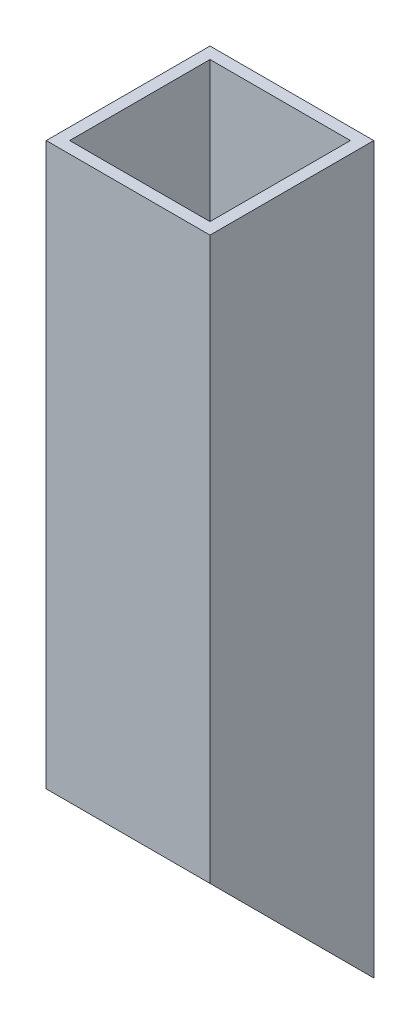
ISO-10303-21;
HEADER;
FILE_DESCRIPTION(('STEP AP214'),'2;1');
FILE_NAME('part.step','',(''),(''),'','','');
FILE_SCHEMA(('AUTOMOTIVE_DESIGN { 1 0 10303 214 1 1 1 1 }'));
ENDSEC;
DATA;
#1=APPLICATION_CONTEXT('core data for automotive mechanical design processes');
#2=APPLICATION_PROTOCOL_DEFINITION('international standard','automotive_design',2000,#1);
#3=PRODUCT_CONTEXT('',#1,'mechanical');
#4=PRODUCT('Part','Part','',(#3));
#5=PRODUCT_RELATED_PRODUCT_CATEGORY('part','',(#4));
#6=PRODUCT_DEFINITION_FORMATION('','',#4);
#7=PRODUCT_DEFINITION_CONTEXT('part definition',#1,'design');
#8=PRODUCT_DEFINITION('design','',#6,#7);
#9=PRODUCT_DEFINITION_SHAPE('','',#8);
#10=(LENGTH_UNIT() NAMED_UNIT(*) SI_UNIT(.MILLI.,.METRE.));
#11=(NAMED_UNIT(*) PLANE_ANGLE_UNIT() SI_UNIT($,.RADIAN.));
#12=(NAMED_UNIT(*) SI_UNIT($,.STERADIAN.) SOLID_ANGLE_UNIT());
#13=UNCERTAINTY_MEASURE_WITH_UNIT(LENGTH_MEASURE(1.E-05),#10,'distance_accuracy_value','');
#14=(GEOMETRIC_REPRESENTATION_CONTEXT(3) GLOBAL_UNCERTAINTY_ASSIGNED_CONTEXT((#13)) GLOBAL_UNIT_ASSIGNED_CONTEXT((#10,
#11,#12)) REPRESENTATION_CONTEXT('',''));
#15=CARTESIAN_POINT('',(0.,0.,0.));
#16=DIRECTION('',(0.,0.,1.));
#17=DIRECTION('',(1.,0.,0.));
#18=AXIS2_PLACEMENT_3D('',#15,#16,#17);
#19=CARTESIAN_POINT('',(0.,196.85,0.));
#20=DIRECTION('',(0.,-1.,0.));
#21=DIRECTION('',(0.,0.,-1.));
#22=AXIS2_PLACEMENT_3D('',#19,#20,#21);
#23=PLANE('',#22);
#24=DIRECTION('',(0.,0.,1.));
#25=VECTOR('',#24,1.);
#26=CARTESIAN_POINT('',(0.,196.85,0.));
#27=LINE('',#26,#25);
#28=CARTESIAN_POINT('',(0.,196.85,-44.45));
#29=VERTEX_POINT('',#28);
#30=CARTESIAN_POINT('',(0.,196.85,0.));
#31=VERTEX_POINT('',#30);
#32=EDGE_CURVE('E121',#29,#31,#27,.T.);
#33=ORIENTED_EDGE('',*,*,#32,.T.);
#34=DIRECTION('',(1.,0.,0.));
#35=VECTOR('',#34,1.);
#36=CARTESIAN_POINT('',(0.,196.85,0.));
#37=LINE('',#36,#35);
#38=CARTESIAN_POINT('',(44.45,196.85,0.));
#39=VERTEX_POINT('',#38);
#40=EDGE_CURVE('E127',#31,#39,#37,.T.);
#41=ORIENTED_EDGE('',*,*,#40,.T.);
#42=DIRECTION('',(0.,0.,-1.));
#43=VECTOR('',#42,1.);
#44=CARTESIAN_POINT('',(44.45,196.85,0.));
#45=LINE('',#44,#43);
#46=CARTESIAN_POINT('',(44.45,196.85,-44.45));
#47=VERTEX_POINT('',#46);
#48=EDGE_CURVE('E124',#39,#47,#45,.T.);
#49=ORIENTED_EDGE('',*,*,#48,.T.);
#50=DIRECTION('',(-1.,0.,0.));
#51=VECTOR('',#50,1.);
#52=CARTESIAN_POINT('',(0.,196.85,-44.45));
#53=LINE('',#52,#51);
#54=EDGE_CURVE('E118',#47,#29,#53,.T.);
#55=ORIENTED_EDGE('',*,*,#54,.T.);
#56=EDGE_LOOP('',(#33,#41,#49,#55));
#57=FACE_BOUND('',#56,.T.);
#58=DIRECTION('',(1.,0.,0.));
#59=VECTOR('',#58,1.);
#60=CARTESIAN_POINT('',(3.175,196.85,-3.175));
#61=LINE('',#60,#59);
#62=CARTESIAN_POINT('',(3.175,196.85,-3.175));
#63=VERTEX_POINT('',#62);
#64=CARTESIAN_POINT('',(41.275,196.85,-3.175));
#65=VERTEX_POINT('',#64);
#66=EDGE_CURVE('E89',#63,#65,#61,.T.);
#67=ORIENTED_EDGE('',*,*,#66,.F.);
#68=DIRECTION('',(0.,0.,1.));
#69=VECTOR('',#68,1.);
#70=CARTESIAN_POINT('',(3.175,196.85,-3.175));
#71=LINE('',#70,#69);
#72=CARTESIAN_POINT('',(3.175,196.85,-41.275));
#73=VERTEX_POINT('',#72);
#74=EDGE_CURVE('E137',#73,#63,#71,.T.);
#75=ORIENTED_EDGE('',*,*,#74,.F.);
#76=DIRECTION('',(-1.,0.,0.));
#77=VECTOR('',#76,1.);
#78=CARTESIAN_POINT('',(3.175,196.85,-41.275));
#79=LINE('',#78,#77);
#80=CARTESIAN_POINT('',(41.275,196.85,-41.275));
#81=VERTEX_POINT('',#80);
#82=EDGE_CURVE('E140',#81,#73,#79,.T.);
#83=ORIENTED_EDGE('',*,*,#82,.F.);
#84=DIRECTION('',(0.,0.,-1.));
#85=VECTOR('',#84,1.);
#86=CARTESIAN_POINT('',(41.275,196.85,-3.175));
#87=LINE('',#86,#85);
#88=EDGE_CURVE('E99',#65,#81,#87,.T.);
#89=ORIENTED_EDGE('',*,*,#88,.F.);
#90=EDGE_LOOP('',(#67,#75,#83,#89));
#91=FACE_BOUND('',#90,.T.);
#92=ADVANCED_FACE('F34',(#57,#91),#23,.F.);
#93=CARTESIAN_POINT('',(0.,196.85,0.));
#94=DIRECTION('',(1.,0.,0.));
#95=DIRECTION('',(0.,0.,-1.));
#96=AXIS2_PLACEMENT_3D('',#93,#94,#95);
#97=PLANE('',#96);
#98=DIRECTION('',(0.,-1.,0.));
#99=VECTOR('',#98,1.);
#100=CARTESIAN_POINT('',(0.,196.85,-44.45));
#101=LINE('',#100,#99);
#102=CARTESIAN_POINT('',(0.,0.,-44.45));
#103=VERTEX_POINT('',#102);
#104=EDGE_CURVE('E116',#29,#103,#101,.T.);
#105=ORIENTED_EDGE('',*,*,#104,.T.);
#106=DIRECTION('',(0.,0.707106781186546,0.707106781186549));
#107=VECTOR('',#106,1.);
#108=CARTESIAN_POINT('',(0.,44.45,0.));
#109=LINE('',#108,#107);
#110=CARTESIAN_POINT('',(0.,44.45,0.));
#111=VERTEX_POINT('',#110);
#112=EDGE_CURVE('E11',#103,#111,#109,.T.);
#113=ORIENTED_EDGE('',*,*,#112,.T.);
#114=DIRECTION('',(0.,-1.,0.));
#115=VECTOR('',#114,1.);
#116=CARTESIAN_POINT('',(0.,196.85,0.));
#117=LINE('',#116,#115);
#118=EDGE_CURVE('E108',#31,#111,#117,.T.);
#119=ORIENTED_EDGE('',*,*,#118,.F.);
#120=ORIENTED_EDGE('',*,*,#32,.F.);
#121=EDGE_LOOP('',(#105,#113,#119,#120));
#122=FACE_BOUND('',#121,.T.);
#123=ADVANCED_FACE('F174',(#122),#97,.F.);
#124=CARTESIAN_POINT('',(0.,196.85,0.));
#125=DIRECTION('',(0.,0.,-1.));
#126=DIRECTION('',(-1.,0.,0.));
#127=AXIS2_PLACEMENT_3D('',#124,#125,#126);
#128=PLANE('',#127);
#129=ORIENTED_EDGE('',*,*,#118,.T.);
#130=DIRECTION('',(1.,0.,0.));
#131=VECTOR('',#130,1.);
#132=CARTESIAN_POINT('',(44.45,44.45,0.));
#133=LINE('',#132,#131);
#134=CARTESIAN_POINT('',(44.45,44.45,0.));
#135=VERTEX_POINT('',#134);
#136=EDGE_CURVE('E105',#111,#135,#133,.T.);
#137=ORIENTED_EDGE('',*,*,#136,.T.);
#138=DIRECTION('',(0.,-1.,0.));
#139=VECTOR('',#138,1.);
#140=CARTESIAN_POINT('',(44.45,196.85,0.));
#141=LINE('',#140,#139);
#142=EDGE_CURVE('E110',#39,#135,#141,.T.);
#143=ORIENTED_EDGE('',*,*,#142,.F.);
#144=ORIENTED_EDGE('',*,*,#40,.F.);
#145=EDGE_LOOP('',(#129,#137,#143,#144));
#146=FACE_BOUND('',#145,.T.);
#147=ADVANCED_FACE('F178',(#146),#128,.F.);
#148=CARTESIAN_POINT('',(44.45,196.85,0.));
#149=DIRECTION('',(-1.,0.,0.));
#150=DIRECTION('',(0.,0.,1.));
#151=AXIS2_PLACEMENT_3D('',#148,#149,#150);
#152=PLANE('',#151);
#153=ORIENTED_EDGE('',*,*,#142,.T.);
#154=DIRECTION('',(0.,-0.707106781186546,-0.707106781186549));
#155=VECTOR('',#154,1.);
#156=CARTESIAN_POINT('',(44.45,44.45,0.));
#157=LINE('',#156,#155);
#158=CARTESIAN_POINT('',(44.45,0.,-44.45));
#159=VERTEX_POINT('',#158);
#160=EDGE_CURVE('E44',#135,#159,#157,.T.);
#161=ORIENTED_EDGE('',*,*,#160,.T.);
#162=DIRECTION('',(0.,-1.,0.));
#163=VECTOR('',#162,1.);
#164=CARTESIAN_POINT('',(44.45,196.85,-44.45));
#165=LINE('',#164,#163);
#166=EDGE_CURVE('E113',#47,#159,#165,.T.);
#167=ORIENTED_EDGE('',*,*,#166,.F.);
#168=ORIENTED_EDGE('',*,*,#48,.F.);
#169=EDGE_LOOP('',(#153,#161,#167,#168));
#170=FACE_BOUND('',#169,.T.);
#171=ADVANCED_FACE('F181',(#170),#152,.F.);
#172=CARTESIAN_POINT('',(0.,196.85,-44.45));
#173=DIRECTION('',(0.,0.,1.));
#174=DIRECTION('',(1.,0.,0.));
#175=AXIS2_PLACEMENT_3D('',#172,#173,#174);
#176=PLANE('',#175);
#177=DIRECTION('',(-1.,0.,0.));
#178=VECTOR('',#177,1.);
#179=CARTESIAN_POINT('',(0.,0.,-44.45));
#180=LINE('',#179,#178);
#181=EDGE_CURVE('E90',#159,#103,#180,.T.);
#182=ORIENTED_EDGE('',*,*,#181,.T.);
#183=ORIENTED_EDGE('',*,*,#104,.F.);
#184=ORIENTED_EDGE('',*,*,#54,.F.);
#185=ORIENTED_EDGE('',*,*,#166,.T.);
#186=EDGE_LOOP('',(#182,#183,#184,#185));
#187=FACE_BOUND('',#186,.T.);
#188=ADVANCED_FACE('F169',(#187),#176,.F.);
#189=CARTESIAN_POINT('',(3.175,196.85,-3.175));
#190=DIRECTION('',(0.,0.,-1.));
#191=DIRECTION('',(-1.,0.,0.));
#192=AXIS2_PLACEMENT_3D('',#189,#190,#191);
#193=PLANE('',#192);
#194=DIRECTION('',(1.,0.,0.));
#195=VECTOR('',#194,1.);
#196=CARTESIAN_POINT('',(0.,41.275,-3.175));
#197=LINE('',#196,#195);
#198=CARTESIAN_POINT('',(3.175,41.275,-3.175));
#199=VERTEX_POINT('',#198);
#200=CARTESIAN_POINT('',(41.275,41.275,-3.175));
#201=VERTEX_POINT('',#200);
#202=EDGE_CURVE('E38',#199,#201,#197,.T.);
#203=ORIENTED_EDGE('',*,*,#202,.F.);
#204=DIRECTION('',(0.,-1.,0.));
#205=VECTOR('',#204,1.);
#206=CARTESIAN_POINT('',(3.175,196.85,-3.175));
#207=LINE('',#206,#205);
#208=EDGE_CURVE('E135',#63,#199,#207,.T.);
#209=ORIENTED_EDGE('',*,*,#208,.F.);
#210=ORIENTED_EDGE('',*,*,#66,.T.);
#211=DIRECTION('',(0.,-1.,0.));
#212=VECTOR('',#211,1.);
#213=CARTESIAN_POINT('',(41.275,196.85,-3.175));
#214=LINE('',#213,#212);
#215=EDGE_CURVE('E73',#65,#201,#214,.T.);
#216=ORIENTED_EDGE('',*,*,#215,.T.);
#217=EDGE_LOOP('',(#203,#209,#210,#216));
#218=FACE_BOUND('',#217,.T.);
#219=ADVANCED_FACE('F85',(#218),#193,.T.);
#220=CARTESIAN_POINT('',(41.275,196.85,-3.175));
#221=DIRECTION('',(-1.,0.,0.));
#222=DIRECTION('',(0.,0.,1.));
#223=AXIS2_PLACEMENT_3D('',#220,#221,#222);
#224=PLANE('',#223);
#225=DIRECTION('',(0.,-0.707106781186546,-0.707106781186549));
#226=VECTOR('',#225,1.);
#227=CARTESIAN_POINT('',(41.275,44.45,0.));
#228=LINE('',#227,#226);
#229=CARTESIAN_POINT('',(41.275,3.17500000000018,-41.275));
#230=VERTEX_POINT('',#229);
#231=EDGE_CURVE('E69',#201,#230,#228,.T.);
#232=ORIENTED_EDGE('',*,*,#231,.F.);
#233=ORIENTED_EDGE('',*,*,#215,.F.);
#234=ORIENTED_EDGE('',*,*,#88,.T.);
#235=DIRECTION('',(0.,-1.,0.));
#236=VECTOR('',#235,1.);
#237=CARTESIAN_POINT('',(41.275,196.85,-41.275));
#238=LINE('',#237,#236);
#239=EDGE_CURVE('E76',#81,#230,#238,.T.);
#240=ORIENTED_EDGE('',*,*,#239,.T.);
#241=EDGE_LOOP('',(#232,#233,#234,#240));
#242=FACE_BOUND('',#241,.T.);
#243=ADVANCED_FACE('F71',(#242),#224,.T.);
#244=CARTESIAN_POINT('',(3.175,196.85,-41.275));
#245=DIRECTION('',(0.,0.,1.));
#246=DIRECTION('',(1.,0.,0.));
#247=AXIS2_PLACEMENT_3D('',#244,#245,#246);
#248=PLANE('',#247);
#249=DIRECTION('',(-1.,0.,0.));
#250=VECTOR('',#249,1.);
#251=CARTESIAN_POINT('',(0.,3.17500000000015,-41.275));
#252=LINE('',#251,#250);
#253=CARTESIAN_POINT('',(3.175,3.17500000000018,-41.275));
#254=VERTEX_POINT('',#253);
#255=EDGE_CURVE('E81',#230,#254,#252,.T.);
#256=ORIENTED_EDGE('',*,*,#255,.F.);
#257=ORIENTED_EDGE('',*,*,#239,.F.);
#258=ORIENTED_EDGE('',*,*,#82,.T.);
#259=DIRECTION('',(0.,-1.,0.));
#260=VECTOR('',#259,1.);
#261=CARTESIAN_POINT('',(3.175,196.85,-41.275));
#262=LINE('',#261,#260);
#263=EDGE_CURVE('E133',#73,#254,#262,.T.);
#264=ORIENTED_EDGE('',*,*,#263,.T.);
#265=EDGE_LOOP('',(#256,#257,#258,#264));
#266=FACE_BOUND('',#265,.T.);
#267=ADVANCED_FACE('F149',(#266),#248,.T.);
#268=CARTESIAN_POINT('',(3.175,196.85,-3.175));
#269=DIRECTION('',(1.,0.,0.));
#270=DIRECTION('',(0.,0.,-1.));
#271=AXIS2_PLACEMENT_3D('',#268,#269,#270);
#272=PLANE('',#271);
#273=DIRECTION('',(0.,0.707106781186546,0.707106781186549));
#274=VECTOR('',#273,1.);
#275=CARTESIAN_POINT('',(3.175,44.45,0.));
#276=LINE('',#275,#274);
#277=EDGE_CURVE('E94',#254,#199,#276,.T.);
#278=ORIENTED_EDGE('',*,*,#277,.F.);
#279=ORIENTED_EDGE('',*,*,#263,.F.);
#280=ORIENTED_EDGE('',*,*,#74,.T.);
#281=ORIENTED_EDGE('',*,*,#208,.T.);
#282=EDGE_LOOP('',(#278,#279,#280,#281));
#283=FACE_BOUND('',#282,.T.);
#284=ADVANCED_FACE('F151',(#283),#272,.T.);
#285=CARTESIAN_POINT('',(0.,44.45,0.));
#286=DIRECTION('',(0.,-0.707106781186549,0.707106781186546));
#287=DIRECTION('',(-1.,0.,0.));
#288=AXIS2_PLACEMENT_3D('',#285,#286,#287);
#289=PLANE('',#288);
#290=ORIENTED_EDGE('',*,*,#112,.F.);
#291=ORIENTED_EDGE('',*,*,#181,.F.);
#292=ORIENTED_EDGE('',*,*,#160,.F.);
#293=ORIENTED_EDGE('',*,*,#136,.F.);
#294=EDGE_LOOP('',(#290,#291,#292,#293));
#295=FACE_BOUND('',#294,.T.);
#296=ORIENTED_EDGE('',*,*,#277,.T.);
#297=ORIENTED_EDGE('',*,*,#202,.T.);
#298=ORIENTED_EDGE('',*,*,#231,.T.);
#299=ORIENTED_EDGE('',*,*,#255,.T.);
#300=EDGE_LOOP('',(#296,#297,#298,#299));
#301=FACE_BOUND('',#300,.T.);
#302=ADVANCED_FACE('F36',(#295,#301),#289,.T.);
#303=CLOSED_SHELL('',(#92,#123,#147,#171,#188,#219,#243,#267,#284,#302));
#304=MANIFOLD_SOLID_BREP('B2',#303);
#305=ADVANCED_BREP_SHAPE_REPRESENTATION('',(#18,#304),#14);
#306=SHAPE_DEFINITION_REPRESENTATION(#9,#305);
ENDSEC;
END-ISO-10303-21;
